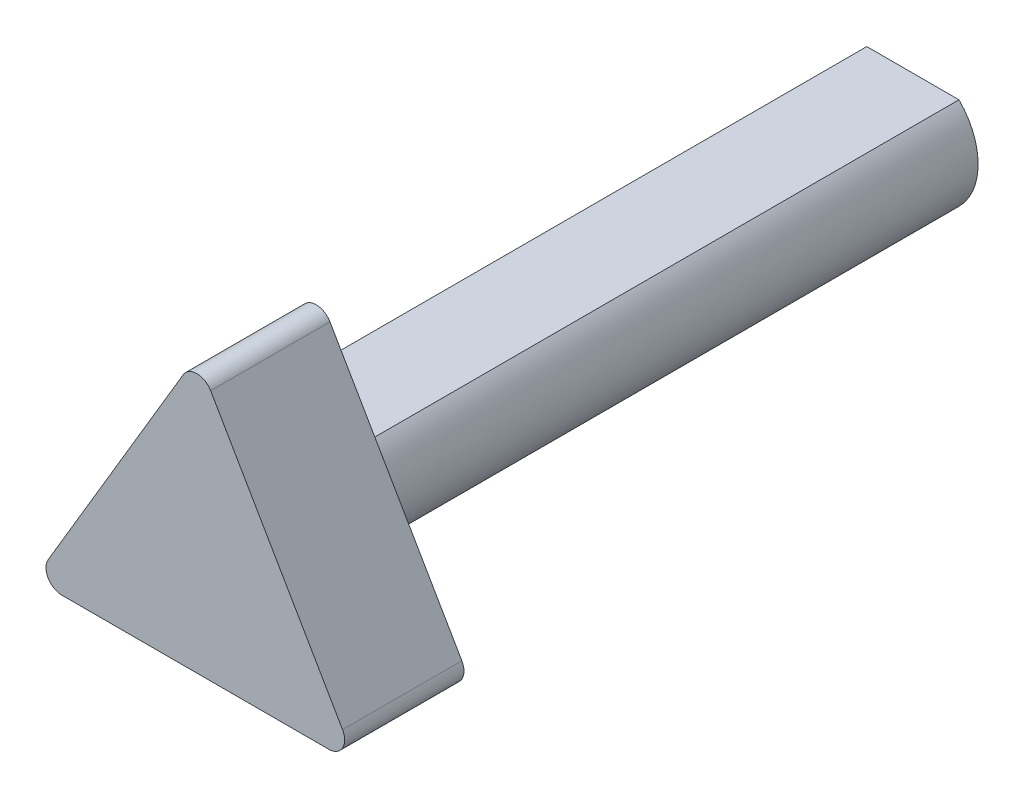
ISO-10303-21;
HEADER;
FILE_DESCRIPTION(('STEP AP214'),'2;1');
FILE_NAME('part.step','',(''),(''),'','','');
FILE_SCHEMA(('AUTOMOTIVE_DESIGN { 1 0 10303 214 1 1 1 1 }'));
ENDSEC;
DATA;
#1=APPLICATION_CONTEXT('core data for automotive mechanical design processes');
#2=APPLICATION_PROTOCOL_DEFINITION('international standard','automotive_design',2000,#1);
#3=PRODUCT_CONTEXT('',#1,'mechanical');
#4=PRODUCT('Part','Part','',(#3));
#5=PRODUCT_RELATED_PRODUCT_CATEGORY('part','',(#4));
#6=PRODUCT_DEFINITION_FORMATION('','',#4);
#7=PRODUCT_DEFINITION_CONTEXT('part definition',#1,'design');
#8=PRODUCT_DEFINITION('design','',#6,#7);
#9=PRODUCT_DEFINITION_SHAPE('','',#8);
#10=(LENGTH_UNIT() NAMED_UNIT(*) SI_UNIT(.MILLI.,.METRE.));
#11=(NAMED_UNIT(*) PLANE_ANGLE_UNIT() SI_UNIT($,.RADIAN.));
#12=(NAMED_UNIT(*) SI_UNIT($,.STERADIAN.) SOLID_ANGLE_UNIT());
#13=UNCERTAINTY_MEASURE_WITH_UNIT(LENGTH_MEASURE(1.E-05),#10,'distance_accuracy_value','');
#14=(GEOMETRIC_REPRESENTATION_CONTEXT(3) GLOBAL_UNCERTAINTY_ASSIGNED_CONTEXT((#13)) GLOBAL_UNIT_ASSIGNED_CONTEXT((#10,
#11,#12)) REPRESENTATION_CONTEXT('',''));
#15=CARTESIAN_POINT('',(0.,0.,0.));
#16=DIRECTION('',(0.,0.,1.));
#17=DIRECTION('',(1.,0.,0.));
#18=AXIS2_PLACEMENT_3D('',#15,#16,#17);
#19=CARTESIAN_POINT('',(0.,0.,-114.3));
#20=DIRECTION('',(0.,0.,1.));
#21=DIRECTION('',(1.,0.,0.));
#22=AXIS2_PLACEMENT_3D('',#19,#20,#21);
#23=CYLINDRICAL_SURFACE('',#22,10.414);
#24=DIRECTION('',(0.,0.,1.));
#25=VECTOR('',#24,1.);
#26=CARTESIAN_POINT('',(7.3594523828656,7.36816507852083,-114.3));
#27=LINE('',#26,#25);
#28=CARTESIAN_POINT('',(7.3594523828656,7.36816507852083,-114.3));
#29=VERTEX_POINT('',#28);
#30=CARTESIAN_POINT('',(7.3594523828656,7.36816507852083,-19.05));
#31=VERTEX_POINT('',#30);
#32=EDGE_CURVE('E44',#29,#31,#27,.T.);
#33=ORIENTED_EDGE('',*,*,#32,.T.);
#34=CARTESIAN_POINT('',(0.,0.,-19.05));
#35=DIRECTION('',(0.,0.,1.));
#36=DIRECTION('',(1.,0.,0.));
#37=AXIS2_PLACEMENT_3D('',#34,#35,#36);
#38=CIRCLE('',#37,10.414);
#39=CARTESIAN_POINT('',(7.3594523828656,-7.36816507852083,-19.05));
#40=VERTEX_POINT('',#39);
#41=EDGE_CURVE('E58',#40,#31,#38,.T.);
#42=ORIENTED_EDGE('',*,*,#41,.F.);
#43=DIRECTION('',(0.,0.,1.));
#44=VECTOR('',#43,1.);
#45=CARTESIAN_POINT('',(7.3594523828656,-7.36816507852083,-114.3));
#46=LINE('',#45,#44);
#47=CARTESIAN_POINT('',(7.3594523828656,-7.36816507852083,-114.3));
#48=VERTEX_POINT('',#47);
#49=EDGE_CURVE('E11',#48,#40,#46,.T.);
#50=ORIENTED_EDGE('',*,*,#49,.F.);
#51=CARTESIAN_POINT('',(0.,0.,-114.3));
#52=DIRECTION('',(0.,0.,1.));
#53=DIRECTION('',(1.,0.,0.));
#54=AXIS2_PLACEMENT_3D('',#51,#52,#53);
#55=CIRCLE('',#54,10.414);
#56=EDGE_CURVE('E154',#48,#29,#55,.T.);
#57=ORIENTED_EDGE('',*,*,#56,.T.);
#58=EDGE_LOOP('',(#33,#42,#50,#57));
#59=FACE_BOUND('',#58,.T.);
#60=ADVANCED_FACE('F41',(#59),#23,.T.);
#61=CARTESIAN_POINT('',(-7.3594523828656,-7.36816507852083,-114.3));
#62=DIRECTION('',(0.,-1.,0.));
#63=DIRECTION('',(0.,0.,-1.));
#64=AXIS2_PLACEMENT_3D('',#61,#62,#63);
#65=PLANE('',#64);
#66=ORIENTED_EDGE('',*,*,#49,.T.);
#67=DIRECTION('',(1.,0.,0.));
#68=VECTOR('',#67,1.);
#69=CARTESIAN_POINT('',(0.,-7.36816507852083,-19.05));
#70=LINE('',#69,#68);
#71=CARTESIAN_POINT('',(-7.3594523828656,-7.36816507852083,-19.05));
#72=VERTEX_POINT('',#71);
#73=EDGE_CURVE('E218',#72,#40,#70,.T.);
#74=ORIENTED_EDGE('',*,*,#73,.F.);
#75=DIRECTION('',(0.,0.,1.));
#76=VECTOR('',#75,1.);
#77=CARTESIAN_POINT('',(-7.3594523828656,-7.36816507852083,-114.3));
#78=LINE('',#77,#76);
#79=CARTESIAN_POINT('',(-7.3594523828656,-7.36816507852083,-114.3));
#80=VERTEX_POINT('',#79);
#81=EDGE_CURVE('E50',#80,#72,#78,.T.);
#82=ORIENTED_EDGE('',*,*,#81,.F.);
#83=DIRECTION('',(1.,0.,0.));
#84=VECTOR('',#83,1.);
#85=CARTESIAN_POINT('',(-7.3594523828656,-7.36816507852083,-114.3));
#86=LINE('',#85,#84);
#87=EDGE_CURVE('E144',#80,#48,#86,.T.);
#88=ORIENTED_EDGE('',*,*,#87,.T.);
#89=EDGE_LOOP('',(#66,#74,#82,#88));
#90=FACE_BOUND('',#89,.T.);
#91=ADVANCED_FACE('F223',(#90),#65,.T.);
#92=CARTESIAN_POINT('',(0.,0.,-114.3));
#93=DIRECTION('',(0.,0.,1.));
#94=DIRECTION('',(1.,0.,0.));
#95=AXIS2_PLACEMENT_3D('',#92,#93,#94);
#96=CYLINDRICAL_SURFACE('',#95,10.414);
#97=ORIENTED_EDGE('',*,*,#81,.T.);
#98=CARTESIAN_POINT('',(0.,0.,-19.05));
#99=DIRECTION('',(0.,0.,1.));
#100=DIRECTION('',(1.,0.,0.));
#101=AXIS2_PLACEMENT_3D('',#98,#99,#100);
#102=CIRCLE('',#101,10.414);
#103=CARTESIAN_POINT('',(-7.3594523828656,7.36816507852083,-19.05));
#104=VERTEX_POINT('',#103);
#105=EDGE_CURVE('E120',#104,#72,#102,.T.);
#106=ORIENTED_EDGE('',*,*,#105,.F.);
#107=DIRECTION('',(0.,0.,1.));
#108=VECTOR('',#107,1.);
#109=CARTESIAN_POINT('',(-7.3594523828656,7.36816507852083,-114.3));
#110=LINE('',#109,#108);
#111=CARTESIAN_POINT('',(-7.3594523828656,7.36816507852083,-114.3));
#112=VERTEX_POINT('',#111);
#113=EDGE_CURVE('E131',#112,#104,#110,.T.);
#114=ORIENTED_EDGE('',*,*,#113,.F.);
#115=CARTESIAN_POINT('',(0.,0.,-114.3));
#116=DIRECTION('',(0.,0.,1.));
#117=DIRECTION('',(1.,0.,0.));
#118=AXIS2_PLACEMENT_3D('',#115,#116,#117);
#119=CIRCLE('',#118,10.414);
#120=EDGE_CURVE('E149',#112,#80,#119,.T.);
#121=ORIENTED_EDGE('',*,*,#120,.T.);
#122=EDGE_LOOP('',(#97,#106,#114,#121));
#123=FACE_BOUND('',#122,.T.);
#124=ADVANCED_FACE('F129',(#123),#96,.T.);
#125=CARTESIAN_POINT('',(-7.3594523828656,7.36816507852083,-114.3));
#126=DIRECTION('',(0.,1.,0.));
#127=DIRECTION('',(0.,0.,1.));
#128=AXIS2_PLACEMENT_3D('',#125,#126,#127);
#129=PLANE('',#128);
#130=ORIENTED_EDGE('',*,*,#113,.T.);
#131=DIRECTION('',(-1.,0.,0.));
#132=VECTOR('',#131,1.);
#133=CARTESIAN_POINT('',(0.,7.36816507852083,-19.05));
#134=LINE('',#133,#132);
#135=EDGE_CURVE('E116',#31,#104,#134,.T.);
#136=ORIENTED_EDGE('',*,*,#135,.F.);
#137=ORIENTED_EDGE('',*,*,#32,.F.);
#138=DIRECTION('',(-1.,0.,0.));
#139=VECTOR('',#138,1.);
#140=CARTESIAN_POINT('',(-7.3594523828656,7.36816507852083,-114.3));
#141=LINE('',#140,#139);
#142=EDGE_CURVE('E139',#29,#112,#141,.T.);
#143=ORIENTED_EDGE('',*,*,#142,.T.);
#144=EDGE_LOOP('',(#130,#136,#137,#143));
#145=FACE_BOUND('',#144,.T.);
#146=ADVANCED_FACE('F137',(#145),#129,.T.);
#147=CARTESIAN_POINT('',(0.,0.,-114.3));
#148=DIRECTION('',(0.,0.,1.));
#149=DIRECTION('',(1.,0.,0.));
#150=AXIS2_PLACEMENT_3D('',#147,#148,#149);
#151=PLANE('',#150);
#152=ORIENTED_EDGE('',*,*,#56,.F.);
#153=ORIENTED_EDGE('',*,*,#87,.F.);
#154=ORIENTED_EDGE('',*,*,#120,.F.);
#155=ORIENTED_EDGE('',*,*,#142,.F.);
#156=EDGE_LOOP('',(#152,#153,#154,#155));
#157=FACE_BOUND('',#156,.T.);
#158=ADVANCED_FACE('F226',(#157),#151,.F.);
#159=CARTESIAN_POINT('',(21.0317505261134,-15.9189140934706,-19.05));
#160=DIRECTION('',(0.,0.,1.));
#161=DIRECTION('',(1.,0.,0.));
#162=AXIS2_PLACEMENT_3D('',#159,#160,#161);
#163=CYLINDRICAL_SURFACE('',#162,2.54);
#164=CARTESIAN_POINT('',(21.0317505261134,-15.9189140934706,0.));
#165=DIRECTION('',(0.,0.,1.));
#166=DIRECTION('',(1.,0.,0.));
#167=AXIS2_PLACEMENT_3D('',#164,#165,#166);
#168=CIRCLE('',#167,2.54);
#169=CARTESIAN_POINT('',(23.2293995530157,-14.645360500348,0.));
#170=VERTEX_POINT('',#169);
#171=CARTESIAN_POINT('',(21.0317505261133,-18.4589140934706,0.));
#172=VERTEX_POINT('',#171);
#173=EDGE_CURVE('E196',#170,#172,#168,.F.);
#174=ORIENTED_EDGE('',*,*,#173,.T.);
#175=DIRECTION('',(0.,0.,1.));
#176=VECTOR('',#175,1.);
#177=CARTESIAN_POINT('',(21.0317505261133,-18.4589140934706,-19.05));
#178=LINE('',#177,#176);
#179=CARTESIAN_POINT('',(21.0317505261133,-18.4589140934706,-19.05));
#180=VERTEX_POINT('',#179);
#181=EDGE_CURVE('E157',#180,#172,#178,.T.);
#182=ORIENTED_EDGE('',*,*,#181,.F.);
#183=CARTESIAN_POINT('',(21.0317505261134,-15.9189140934706,-19.05));
#184=DIRECTION('',(0.,0.,1.));
#185=DIRECTION('',(1.,0.,0.));
#186=AXIS2_PLACEMENT_3D('',#183,#184,#185);
#187=CIRCLE('',#186,2.54);
#188=CARTESIAN_POINT('',(23.2293995530157,-14.645360500348,-19.05));
#189=VERTEX_POINT('',#188);
#190=EDGE_CURVE('E214',#189,#180,#187,.F.);
#191=ORIENTED_EDGE('',*,*,#190,.F.);
#192=DIRECTION('',(0.,0.,1.));
#193=VECTOR('',#192,1.);
#194=CARTESIAN_POINT('',(23.2293995530157,-14.645360500348,-19.05));
#195=LINE('',#194,#193);
#196=EDGE_CURVE('E158',#189,#170,#195,.T.);
#197=ORIENTED_EDGE('',*,*,#196,.T.);
#198=EDGE_LOOP('',(#174,#182,#191,#197));
#199=FACE_BOUND('',#198,.T.);
#200=ADVANCED_FACE('F228',(#199),#163,.T.);
#201=CARTESIAN_POINT('',(0.,-18.4589140934706,-19.05));
#202=DIRECTION('',(0.,1.,0.));
#203=DIRECTION('',(0.,0.,1.));
#204=AXIS2_PLACEMENT_3D('',#201,#202,#203);
#205=PLANE('',#204);
#206=DIRECTION('',(-1.,0.,0.));
#207=VECTOR('',#206,1.);
#208=CARTESIAN_POINT('',(0.,-18.4589140934706,0.));
#209=LINE('',#208,#207);
#210=CARTESIAN_POINT('',(-21.582602224906,-18.4589140934706,0.));
#211=VERTEX_POINT('',#210);
#212=EDGE_CURVE('E134',#172,#211,#209,.T.);
#213=ORIENTED_EDGE('',*,*,#212,.T.);
#214=DIRECTION('',(0.,0.,1.));
#215=VECTOR('',#214,1.);
#216=CARTESIAN_POINT('',(-21.582602224906,-18.4589140934706,-19.05));
#217=LINE('',#216,#215);
#218=CARTESIAN_POINT('',(-21.582602224906,-18.4589140934706,-19.05));
#219=VERTEX_POINT('',#218);
#220=EDGE_CURVE('E175',#219,#211,#217,.T.);
#221=ORIENTED_EDGE('',*,*,#220,.F.);
#222=DIRECTION('',(-1.,0.,0.));
#223=VECTOR('',#222,1.);
#224=CARTESIAN_POINT('',(0.,-18.4589140934706,-19.05));
#225=LINE('',#224,#223);
#226=EDGE_CURVE('E163',#180,#219,#225,.T.);
#227=ORIENTED_EDGE('',*,*,#226,.F.);
#228=ORIENTED_EDGE('',*,*,#181,.T.);
#229=EDGE_LOOP('',(#213,#221,#227,#228));
#230=FACE_BOUND('',#229,.T.);
#231=ADVANCED_FACE('F234',(#230),#205,.F.);
#232=CARTESIAN_POINT('',(-21.5826022249061,-15.9189140934706,-19.05));
#233=DIRECTION('',(0.,0.,1.));
#234=DIRECTION('',(1.,0.,0.));
#235=AXIS2_PLACEMENT_3D('',#232,#233,#234);
#236=CYLINDRICAL_SURFACE('',#235,2.54);
#237=CARTESIAN_POINT('',(-21.5826022249061,-15.9189140934706,0.));
#238=DIRECTION('',(0.,0.,1.));
#239=DIRECTION('',(1.,0.,0.));
#240=AXIS2_PLACEMENT_3D('',#237,#238,#239);
#241=CIRCLE('',#240,2.54);
#242=CARTESIAN_POINT('',(-23.7671094443486,-14.6229479642051,0.));
#243=VERTEX_POINT('',#242);
#244=EDGE_CURVE('E184',#211,#243,#241,.F.);
#245=ORIENTED_EDGE('',*,*,#244,.T.);
#246=DIRECTION('',(0.,0.,1.));
#247=VECTOR('',#246,1.);
#248=CARTESIAN_POINT('',(-23.7671094443486,-14.6229479642051,-19.05));
#249=LINE('',#248,#247);
#250=CARTESIAN_POINT('',(-23.7671094443486,-14.6229479642051,-19.05));
#251=VERTEX_POINT('',#250);
#252=EDGE_CURVE('E171',#251,#243,#249,.T.);
#253=ORIENTED_EDGE('',*,*,#252,.F.);
#254=CARTESIAN_POINT('',(-21.5826022249061,-15.9189140934706,-19.05));
#255=DIRECTION('',(0.,0.,1.));
#256=DIRECTION('',(1.,0.,0.));
#257=AXIS2_PLACEMENT_3D('',#254,#255,#256);
#258=CIRCLE('',#257,2.54);
#259=EDGE_CURVE('E202',#219,#251,#258,.F.);
#260=ORIENTED_EDGE('',*,*,#259,.F.);
#261=ORIENTED_EDGE('',*,*,#220,.T.);
#262=EDGE_LOOP('',(#245,#253,#260,#261));
#263=FACE_BOUND('',#262,.T.);
#264=ADVANCED_FACE('F276',(#263),#236,.T.);
#265=CARTESIAN_POINT('',(-11.1631369337099,6.62256788793423,-19.05));
#266=DIRECTION('',(0.860042212378957,-0.510222885537595,0.));
#267=DIRECTION('',(0.510222885537595,0.860042212378957,0.));
#268=AXIS2_PLACEMENT_3D('',#265,#266,#267);
#269=PLANE('',#268);
#270=DIRECTION('',(0.510222885537595,0.860042212378956,0.));
#271=VECTOR('',#270,1.);
#272=CARTESIAN_POINT('',(-11.1631369337099,6.62256788793423,0.));
#273=LINE('',#272,#271);
#274=CARTESIAN_POINT('',(-2.21018971714067,21.7138402508688,0.));
#275=VERTEX_POINT('',#274);
#276=EDGE_CURVE('E187',#243,#275,#273,.T.);
#277=ORIENTED_EDGE('',*,*,#276,.T.);
#278=DIRECTION('',(0.,0.,1.));
#279=VECTOR('',#278,1.);
#280=CARTESIAN_POINT('',(-2.21018971714067,21.7138402508688,-19.05));
#281=LINE('',#280,#279);
#282=CARTESIAN_POINT('',(-2.21018971714067,21.7138402508688,-19.05));
#283=VERTEX_POINT('',#282);
#284=EDGE_CURVE('E167',#283,#275,#281,.T.);
#285=ORIENTED_EDGE('',*,*,#284,.F.);
#286=DIRECTION('',(0.510222885537595,0.860042212378956,0.));
#287=VECTOR('',#286,1.);
#288=CARTESIAN_POINT('',(-11.1631369337099,6.62256788793423,-19.05));
#289=LINE('',#288,#287);
#290=EDGE_CURVE('E205',#251,#283,#289,.T.);
#291=ORIENTED_EDGE('',*,*,#290,.F.);
#292=ORIENTED_EDGE('',*,*,#252,.T.);
#293=EDGE_LOOP('',(#277,#285,#291,#292));
#294=FACE_BOUND('',#293,.T.);
#295=ADVANCED_FACE('F271',(#294),#269,.F.);
#296=CARTESIAN_POINT('',(-0.0256824976981156,20.4178741216033,-19.05));
#297=DIRECTION('',(0.,0.,1.));
#298=DIRECTION('',(1.,0.,0.));
#299=AXIS2_PLACEMENT_3D('',#296,#297,#298);
#300=CYLINDRICAL_SURFACE('',#299,2.54);
#301=CARTESIAN_POINT('',(-0.0256824976981156,20.4178741216033,0.));
#302=DIRECTION('',(0.,0.,1.));
#303=DIRECTION('',(1.,0.,0.));
#304=AXIS2_PLACEMENT_3D('',#301,#302,#303);
#305=CIRCLE('',#304,2.54);
#306=CARTESIAN_POINT('',(2.17196652920421,21.6914277147259,0.));
#307=VERTEX_POINT('',#306);
#308=EDGE_CURVE('E190',#275,#307,#305,.F.);
#309=ORIENTED_EDGE('',*,*,#308,.T.);
#310=DIRECTION('',(0.,0.,1.));
#311=VECTOR('',#310,1.);
#312=CARTESIAN_POINT('',(2.17196652920421,21.6914277147259,-19.05));
#313=LINE('',#312,#311);
#314=CARTESIAN_POINT('',(2.17196652920421,21.6914277147259,-19.05));
#315=VERTEX_POINT('',#314);
#316=EDGE_CURVE('E162',#315,#307,#313,.T.);
#317=ORIENTED_EDGE('',*,*,#316,.F.);
#318=CARTESIAN_POINT('',(-0.0256824976981156,20.4178741216033,-19.05));
#319=DIRECTION('',(0.,0.,1.));
#320=DIRECTION('',(1.,0.,0.));
#321=AXIS2_PLACEMENT_3D('',#318,#319,#320);
#322=CIRCLE('',#321,2.54);
#323=EDGE_CURVE('E208',#283,#315,#322,.F.);
#324=ORIENTED_EDGE('',*,*,#323,.F.);
#325=ORIENTED_EDGE('',*,*,#284,.T.);
#326=EDGE_LOOP('',(#309,#317,#324,#325));
#327=FACE_BOUND('',#326,.T.);
#328=ADVANCED_FACE('F267',(#327),#300,.T.);
#329=CARTESIAN_POINT('',(11.0360758624032,6.39548622026677,-19.05));
#330=DIRECTION('',(-0.865216152323745,-0.501399052410446,0.));
#331=DIRECTION('',(0.501399052410446,-0.865216152323745,0.));
#332=AXIS2_PLACEMENT_3D('',#329,#330,#331);
#333=PLANE('',#332);
#334=DIRECTION('',(0.501399052410446,-0.865216152323745,0.));
#335=VECTOR('',#334,1.);
#336=CARTESIAN_POINT('',(11.0360758624032,6.39548622026677,0.));
#337=LINE('',#336,#335);
#338=EDGE_CURVE('E193',#307,#170,#337,.T.);
#339=ORIENTED_EDGE('',*,*,#338,.T.);
#340=ORIENTED_EDGE('',*,*,#196,.F.);
#341=DIRECTION('',(0.501399052410446,-0.865216152323745,0.));
#342=VECTOR('',#341,1.);
#343=CARTESIAN_POINT('',(11.0360758624032,6.39548622026677,-19.05));
#344=LINE('',#343,#342);
#345=EDGE_CURVE('E211',#315,#189,#344,.T.);
#346=ORIENTED_EDGE('',*,*,#345,.F.);
#347=ORIENTED_EDGE('',*,*,#316,.T.);
#348=EDGE_LOOP('',(#339,#340,#346,#347));
#349=FACE_BOUND('',#348,.T.);
#350=ADVANCED_FACE('F253',(#349),#333,.F.);
#351=CARTESIAN_POINT('',(0.,0.,-19.05));
#352=DIRECTION('',(0.,0.,1.));
#353=DIRECTION('',(1.,0.,0.));
#354=AXIS2_PLACEMENT_3D('',#351,#352,#353);
#355=PLANE('',#354);
#356=ORIENTED_EDGE('',*,*,#105,.T.);
#357=ORIENTED_EDGE('',*,*,#73,.T.);
#358=ORIENTED_EDGE('',*,*,#41,.T.);
#359=ORIENTED_EDGE('',*,*,#135,.T.);
#360=EDGE_LOOP('',(#356,#357,#358,#359));
#361=FACE_BOUND('',#360,.T.);
#362=ORIENTED_EDGE('',*,*,#190,.T.);
#363=ORIENTED_EDGE('',*,*,#226,.T.);
#364=ORIENTED_EDGE('',*,*,#259,.T.);
#365=ORIENTED_EDGE('',*,*,#290,.T.);
#366=ORIENTED_EDGE('',*,*,#323,.T.);
#367=ORIENTED_EDGE('',*,*,#345,.T.);
#368=EDGE_LOOP('',(#362,#363,#364,#365,#366,#367));
#369=FACE_BOUND('',#368,.T.);
#370=ADVANCED_FACE('F118',(#361,#369),#355,.F.);
#371=CARTESIAN_POINT('',(0.,0.,0.));
#372=DIRECTION('',(0.,0.,1.));
#373=DIRECTION('',(1.,0.,0.));
#374=AXIS2_PLACEMENT_3D('',#371,#372,#373);
#375=PLANE('',#374);
#376=ORIENTED_EDGE('',*,*,#173,.F.);
#377=ORIENTED_EDGE('',*,*,#338,.F.);
#378=ORIENTED_EDGE('',*,*,#308,.F.);
#379=ORIENTED_EDGE('',*,*,#276,.F.);
#380=ORIENTED_EDGE('',*,*,#244,.F.);
#381=ORIENTED_EDGE('',*,*,#212,.F.);
#382=EDGE_LOOP('',(#376,#377,#378,#379,#380,#381));
#383=FACE_BOUND('',#382,.T.);
#384=ADVANCED_FACE('F247',(#383),#375,.T.);
#385=CLOSED_SHELL('',(#60,#91,#124,#146,#158,#200,#231,#264,#295,#328,#350,#370,#384));
#386=MANIFOLD_SOLID_BREP('B2',#385);
#387=ADVANCED_BREP_SHAPE_REPRESENTATION('',(#18,#386),#14);
#388=SHAPE_DEFINITION_REPRESENTATION(#9,#387);
ENDSEC;
END-ISO-10303-21;
